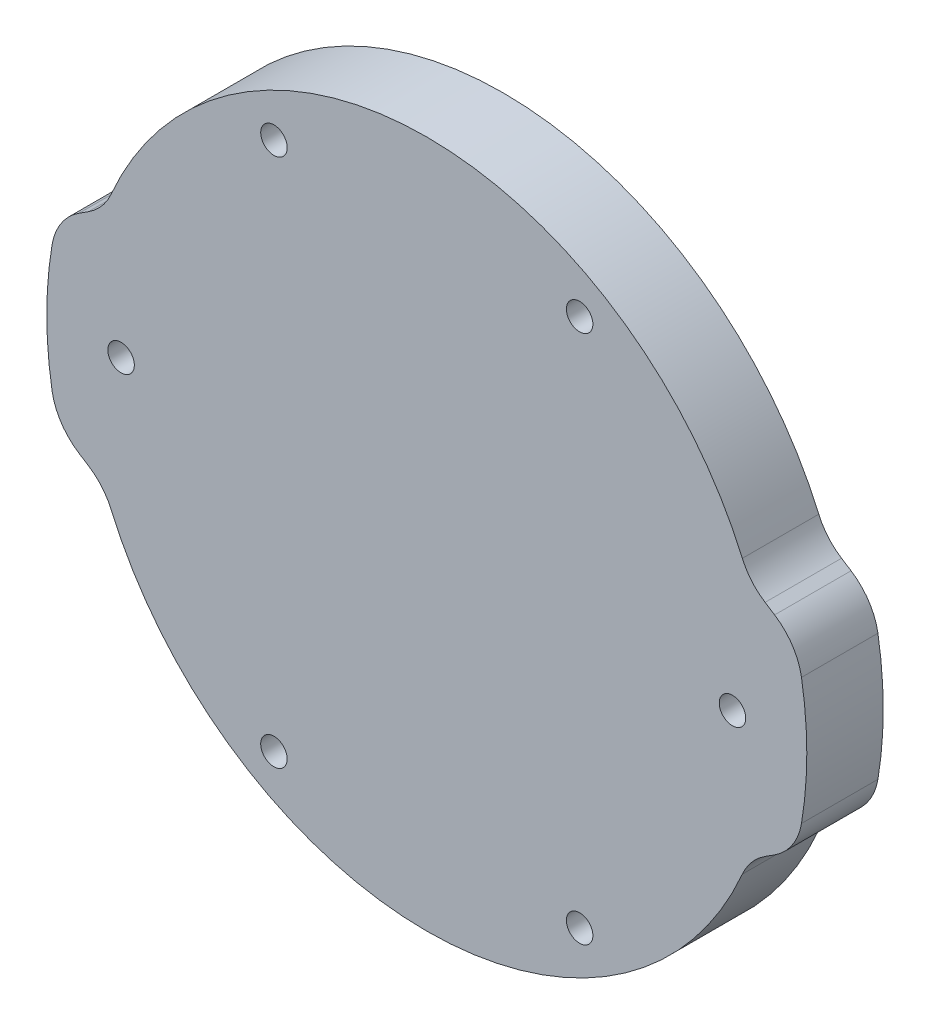
ISO-10303-21;
HEADER;
FILE_DESCRIPTION(('STEP AP214'),'2;1');
FILE_NAME('part.step','',(''),(''),'','','');
FILE_SCHEMA(('AUTOMOTIVE_DESIGN { 1 0 10303 214 1 1 1 1 }'));
ENDSEC;
DATA;
#1=APPLICATION_CONTEXT('core data for automotive mechanical design processes');
#2=APPLICATION_PROTOCOL_DEFINITION('international standard','automotive_design',2000,#1);
#3=PRODUCT_CONTEXT('',#1,'mechanical');
#4=PRODUCT('Part','Part','',(#3));
#5=PRODUCT_RELATED_PRODUCT_CATEGORY('part','',(#4));
#6=PRODUCT_DEFINITION_FORMATION('','',#4);
#7=PRODUCT_DEFINITION_CONTEXT('part definition',#1,'design');
#8=PRODUCT_DEFINITION('design','',#6,#7);
#9=PRODUCT_DEFINITION_SHAPE('','',#8);
#10=(LENGTH_UNIT() NAMED_UNIT(*) SI_UNIT(.MILLI.,.METRE.));
#11=(NAMED_UNIT(*) PLANE_ANGLE_UNIT() SI_UNIT($,.RADIAN.));
#12=(NAMED_UNIT(*) SI_UNIT($,.STERADIAN.) SOLID_ANGLE_UNIT());
#13=UNCERTAINTY_MEASURE_WITH_UNIT(LENGTH_MEASURE(1.E-05),#10,'distance_accuracy_value','');
#14=(GEOMETRIC_REPRESENTATION_CONTEXT(3) GLOBAL_UNCERTAINTY_ASSIGNED_CONTEXT((#13)) GLOBAL_UNIT_ASSIGNED_CONTEXT((#10,
#11,#12)) REPRESENTATION_CONTEXT('',''));
#15=CARTESIAN_POINT('',(0.,0.,0.));
#16=DIRECTION('',(0.,0.,1.));
#17=DIRECTION('',(1.,0.,0.));
#18=AXIS2_PLACEMENT_3D('',#15,#16,#17);
#19=CARTESIAN_POINT('',(0.,0.,6.35));
#20=DIRECTION('',(0.,0.,-1.));
#21=DIRECTION('',(-1.,0.,0.));
#22=AXIS2_PLACEMENT_3D('',#19,#20,#21);
#23=PLANE('',#22);
#24=CARTESIAN_POINT('',(25.4000000000023,0.,6.35));
#25=DIRECTION('',(0.,0.,1.));
#26=DIRECTION('',(1.,0.,0.));
#27=AXIS2_PLACEMENT_3D('',#24,#25,#26);
#28=CIRCLE('',#27,1.10000000000001);
#29=CARTESIAN_POINT('',(26.5000000000024,0.,6.35));
#30=VERTEX_POINT('',#29);
#31=EDGE_CURVE('E556',#30,#30,#28,.T.);
#32=ORIENTED_EDGE('',*,*,#31,.F.);
#33=EDGE_LOOP('',(#32));
#34=FACE_BOUND('',#33,.T.);
#35=CARTESIAN_POINT('',(-12.7000000000012,21.9970452561268,6.35));
#36=DIRECTION('',(0.,0.,1.));
#37=DIRECTION('',(1.,0.,0.));
#38=AXIS2_PLACEMENT_3D('',#35,#36,#37);
#39=CIRCLE('',#38,1.1);
#40=CARTESIAN_POINT('',(-11.6000000000012,21.9970452561268,6.35));
#41=VERTEX_POINT('',#40);
#42=EDGE_CURVE('E568',#41,#41,#39,.T.);
#43=ORIENTED_EDGE('',*,*,#42,.F.);
#44=EDGE_LOOP('',(#43));
#45=FACE_BOUND('',#44,.T.);
#46=CARTESIAN_POINT('',(-25.4000000000023,0.,6.35));
#47=DIRECTION('',(0.,0.,1.));
#48=DIRECTION('',(1.,0.,0.));
#49=AXIS2_PLACEMENT_3D('',#46,#47,#48);
#50=CIRCLE('',#49,1.1);
#51=CARTESIAN_POINT('',(-24.3000000000023,0.,6.35));
#52=VERTEX_POINT('',#51);
#53=EDGE_CURVE('E306',#52,#52,#50,.T.);
#54=ORIENTED_EDGE('',*,*,#53,.F.);
#55=EDGE_LOOP('',(#54));
#56=FACE_BOUND('',#55,.T.);
#57=CARTESIAN_POINT('',(0.,0.,6.35));
#58=DIRECTION('',(0.,0.,1.));
#59=DIRECTION('',(-1.,0.,0.));
#60=AXIS2_PLACEMENT_3D('',#57,#58,#59);
#61=CIRCLE('',#60,31.575);
#62=CARTESIAN_POINT('',(31.1345138238998,-5.25572772785986,6.35));
#63=VERTEX_POINT('',#62);
#64=CARTESIAN_POINT('',(31.1345138238998,5.25572772785986,6.35));
#65=VERTEX_POINT('',#64);
#66=EDGE_CURVE('E195',#63,#65,#61,.T.);
#67=ORIENTED_EDGE('',*,*,#66,.T.);
#68=CARTESIAN_POINT('',(26.2042661874944,4.42346680500002,6.35));
#69=DIRECTION('',(0.,0.,-1.));
#70=DIRECTION('',(-1.,0.,0.));
#71=AXIS2_PLACEMENT_3D('',#68,#69,#70);
#72=CIRCLE('',#71,5.);
#73=CARTESIAN_POINT('',(28.9010073987016,8.63388089862276,6.35));
#74=VERTEX_POINT('',#73);
#75=EDGE_CURVE('E220',#65,#74,#72,.F.);
#76=ORIENTED_EDGE('',*,*,#75,.T.);
#77=DIRECTION('',(-0.842082818724548,0.53934824224143,0.));
#78=VECTOR('',#77,1.);
#79=CARTESIAN_POINT('',(30.6713322990704,7.50000000000001,6.35));
#80=LINE('',#79,#78);
#81=CARTESIAN_POINT('',(28.1095056204985,9.14083233298568,6.35));
#82=VERTEX_POINT('',#81);
#83=EDGE_CURVE('E297',#74,#82,#80,.T.);
#84=ORIENTED_EDGE('',*,*,#83,.T.);
#85=CARTESIAN_POINT('',(30.8062468317057,13.3512464266084,6.35));
#86=DIRECTION('',(0.,0.,-1.));
#87=DIRECTION('',(-1.,0.,0.));
#88=AXIS2_PLACEMENT_3D('',#85,#86,#87);
#89=CIRCLE('',#88,5.);
#90=CARTESIAN_POINT('',(26.2185704606401,11.3629744345595,6.35));
#91=VERTEX_POINT('',#90);
#92=EDGE_CURVE('E158',#82,#91,#89,.T.);
#93=ORIENTED_EDGE('',*,*,#92,.T.);
#94=CARTESIAN_POINT('',(0.,0.,6.35));
#95=DIRECTION('',(0.,0.,1.));
#96=DIRECTION('',(1.,0.,0.));
#97=AXIS2_PLACEMENT_3D('',#94,#95,#96);
#98=CIRCLE('',#97,28.575);
#99=CARTESIAN_POINT('',(-26.2185704606401,11.3629744345595,6.35));
#100=VERTEX_POINT('',#99);
#101=EDGE_CURVE('E168',#91,#100,#98,.T.);
#102=ORIENTED_EDGE('',*,*,#101,.T.);
#103=CARTESIAN_POINT('',(-30.8062468317057,13.3512464266084,6.35));
#104=DIRECTION('',(0.,0.,-1.));
#105=DIRECTION('',(-1.,0.,0.));
#106=AXIS2_PLACEMENT_3D('',#103,#104,#105);
#107=CIRCLE('',#106,5.);
#108=CARTESIAN_POINT('',(-28.1095056204985,9.14083233298567,6.35));
#109=VERTEX_POINT('',#108);
#110=EDGE_CURVE('E11',#100,#109,#107,.T.);
#111=ORIENTED_EDGE('',*,*,#110,.T.);
#112=DIRECTION('',(-0.842082818724547,-0.539348242241431,0.));
#113=VECTOR('',#112,1.);
#114=CARTESIAN_POINT('',(-30.6713322990704,7.5,6.35));
#115=LINE('',#114,#113);
#116=CARTESIAN_POINT('',(-28.9010073987016,8.63388089862276,6.35));
#117=VERTEX_POINT('',#116);
#118=EDGE_CURVE('E292',#109,#117,#115,.T.);
#119=ORIENTED_EDGE('',*,*,#118,.T.);
#120=CARTESIAN_POINT('',(-26.2042661874944,4.42346680500002,6.35));
#121=DIRECTION('',(0.,0.,-1.));
#122=DIRECTION('',(-1.,0.,0.));
#123=AXIS2_PLACEMENT_3D('',#120,#121,#122);
#124=CIRCLE('',#123,5.);
#125=CARTESIAN_POINT('',(-31.1345138238998,5.25572772785986,6.35));
#126=VERTEX_POINT('',#125);
#127=EDGE_CURVE('E214',#117,#126,#124,.F.);
#128=ORIENTED_EDGE('',*,*,#127,.T.);
#129=CARTESIAN_POINT('',(0.,0.,6.35));
#130=DIRECTION('',(0.,0.,1.));
#131=DIRECTION('',(1.,0.,0.));
#132=AXIS2_PLACEMENT_3D('',#129,#130,#131);
#133=CIRCLE('',#132,31.575);
#134=CARTESIAN_POINT('',(-31.1345138238998,-5.25572772785986,6.35));
#135=VERTEX_POINT('',#134);
#136=EDGE_CURVE('E283',#126,#135,#133,.T.);
#137=ORIENTED_EDGE('',*,*,#136,.T.);
#138=CARTESIAN_POINT('',(-26.2042661874944,-4.42346680500002,6.35));
#139=DIRECTION('',(0.,0.,-1.));
#140=DIRECTION('',(-1.,0.,0.));
#141=AXIS2_PLACEMENT_3D('',#138,#139,#140);
#142=CIRCLE('',#141,5.);
#143=CARTESIAN_POINT('',(-28.9010073987016,-8.63388089862276,6.35));
#144=VERTEX_POINT('',#143);
#145=EDGE_CURVE('E216',#135,#144,#142,.F.);
#146=ORIENTED_EDGE('',*,*,#145,.T.);
#147=DIRECTION('',(0.842082818724547,-0.539348242241431,0.));
#148=VECTOR('',#147,1.);
#149=CARTESIAN_POINT('',(-30.6713322990704,-7.5,6.35));
#150=LINE('',#149,#148);
#151=CARTESIAN_POINT('',(-28.1095056204985,-9.14083233298567,6.35));
#152=VERTEX_POINT('',#151);
#153=EDGE_CURVE('E259',#144,#152,#150,.T.);
#154=ORIENTED_EDGE('',*,*,#153,.T.);
#155=CARTESIAN_POINT('',(-30.8062468317057,-13.3512464266084,6.35));
#156=DIRECTION('',(0.,0.,-1.));
#157=DIRECTION('',(-1.,0.,0.));
#158=AXIS2_PLACEMENT_3D('',#155,#156,#157);
#159=CIRCLE('',#158,5.);
#160=CARTESIAN_POINT('',(-26.2185704606401,-11.3629744345595,6.35));
#161=VERTEX_POINT('',#160);
#162=EDGE_CURVE('E251',#152,#161,#159,.T.);
#163=ORIENTED_EDGE('',*,*,#162,.T.);
#164=CARTESIAN_POINT('',(0.,0.,6.35));
#165=DIRECTION('',(0.,0.,1.));
#166=DIRECTION('',(1.,0.,0.));
#167=AXIS2_PLACEMENT_3D('',#164,#165,#166);
#168=CIRCLE('',#167,28.575);
#169=CARTESIAN_POINT('',(26.2185704606401,-11.3629744345595,6.35));
#170=VERTEX_POINT('',#169);
#171=EDGE_CURVE('E257',#161,#170,#168,.T.);
#172=ORIENTED_EDGE('',*,*,#171,.T.);
#173=CARTESIAN_POINT('',(30.8062468317057,-13.3512464266084,6.35));
#174=DIRECTION('',(0.,0.,-1.));
#175=DIRECTION('',(-1.,0.,0.));
#176=AXIS2_PLACEMENT_3D('',#173,#174,#175);
#177=CIRCLE('',#176,5.);
#178=CARTESIAN_POINT('',(28.1095056204985,-9.14083233298568,6.35));
#179=VERTEX_POINT('',#178);
#180=EDGE_CURVE('E56',#170,#179,#177,.T.);
#181=ORIENTED_EDGE('',*,*,#180,.T.);
#182=DIRECTION('',(0.842082818724548,0.53934824224143,0.));
#183=VECTOR('',#182,1.);
#184=CARTESIAN_POINT('',(30.6713322990704,-7.50000000000001,6.35));
#185=LINE('',#184,#183);
#186=CARTESIAN_POINT('',(28.9010073987016,-8.63388089862276,6.35));
#187=VERTEX_POINT('',#186);
#188=EDGE_CURVE('E196',#179,#187,#185,.T.);
#189=ORIENTED_EDGE('',*,*,#188,.T.);
#190=CARTESIAN_POINT('',(26.2042661874944,-4.42346680500002,6.35));
#191=DIRECTION('',(0.,0.,-1.));
#192=DIRECTION('',(-1.,0.,0.));
#193=AXIS2_PLACEMENT_3D('',#190,#191,#192);
#194=CIRCLE('',#193,5.);
#195=EDGE_CURVE('E218',#187,#63,#194,.F.);
#196=ORIENTED_EDGE('',*,*,#195,.T.);
#197=EDGE_LOOP('',(#67,#76,#84,#93,#102,#111,#119,#128,#137,#146,#154,#163,#172,#181,#189,#196));
#198=FACE_BOUND('',#197,.T.);
#199=CARTESIAN_POINT('',(12.7000000000012,-21.9970452561268,6.35));
#200=DIRECTION('',(0.,0.,1.));
#201=DIRECTION('',(1.,0.,0.));
#202=AXIS2_PLACEMENT_3D('',#199,#200,#201);
#203=CIRCLE('',#202,1.1);
#204=CARTESIAN_POINT('',(13.8000000000012,-21.9970452561268,6.35));
#205=VERTEX_POINT('',#204);
#206=EDGE_CURVE('E316',#205,#205,#203,.T.);
#207=ORIENTED_EDGE('',*,*,#206,.F.);
#208=EDGE_LOOP('',(#207));
#209=FACE_BOUND('',#208,.T.);
#210=CARTESIAN_POINT('',(12.7000000000012,21.9970452561268,6.35));
#211=DIRECTION('',(0.,0.,1.));
#212=DIRECTION('',(1.,0.,0.));
#213=AXIS2_PLACEMENT_3D('',#210,#211,#212);
#214=CIRCLE('',#213,1.1);
#215=CARTESIAN_POINT('',(13.8000000000012,21.9970452561268,6.35));
#216=VERTEX_POINT('',#215);
#217=EDGE_CURVE('E562',#216,#216,#214,.T.);
#218=ORIENTED_EDGE('',*,*,#217,.F.);
#219=EDGE_LOOP('',(#218));
#220=FACE_BOUND('',#219,.T.);
#221=CARTESIAN_POINT('',(-12.7000000000012,-21.9970452561268,6.35));
#222=DIRECTION('',(0.,0.,1.));
#223=DIRECTION('',(1.,0.,0.));
#224=AXIS2_PLACEMENT_3D('',#221,#222,#223);
#225=CIRCLE('',#224,1.1);
#226=CARTESIAN_POINT('',(-11.6000000000012,-21.9970452561268,6.35));
#227=VERTEX_POINT('',#226);
#228=EDGE_CURVE('E547',#227,#227,#225,.T.);
#229=ORIENTED_EDGE('',*,*,#228,.F.);
#230=EDGE_LOOP('',(#229));
#231=FACE_BOUND('',#230,.T.);
#232=ADVANCED_FACE('F34',(#34,#45,#56,#198,#209,#220,#231),#23,.F.);
#233=CARTESIAN_POINT('',(0.,0.,0.));
#234=DIRECTION('',(0.,0.,-1.));
#235=DIRECTION('',(-1.,0.,0.));
#236=AXIS2_PLACEMENT_3D('',#233,#234,#235);
#237=PLANE('',#236);
#238=CARTESIAN_POINT('',(25.4000000000023,0.,0.));
#239=DIRECTION('',(0.,0.,1.));
#240=DIRECTION('',(1.,0.,0.));
#241=AXIS2_PLACEMENT_3D('',#238,#239,#240);
#242=CIRCLE('',#241,1.10000000000001);
#243=CARTESIAN_POINT('',(26.5000000000024,0.,0.));
#244=VERTEX_POINT('',#243);
#245=EDGE_CURVE('E553',#244,#244,#242,.T.);
#246=ORIENTED_EDGE('',*,*,#245,.T.);
#247=EDGE_LOOP('',(#246));
#248=FACE_BOUND('',#247,.T.);
#249=CARTESIAN_POINT('',(-12.7000000000012,21.9970452561268,0.));
#250=DIRECTION('',(0.,0.,1.));
#251=DIRECTION('',(1.,0.,0.));
#252=AXIS2_PLACEMENT_3D('',#249,#250,#251);
#253=CIRCLE('',#252,1.1);
#254=CARTESIAN_POINT('',(-11.6000000000012,21.9970452561268,0.));
#255=VERTEX_POINT('',#254);
#256=EDGE_CURVE('E565',#255,#255,#253,.T.);
#257=ORIENTED_EDGE('',*,*,#256,.T.);
#258=EDGE_LOOP('',(#257));
#259=FACE_BOUND('',#258,.T.);
#260=CARTESIAN_POINT('',(-25.4000000000023,0.,0.));
#261=DIRECTION('',(0.,0.,1.));
#262=DIRECTION('',(1.,0.,0.));
#263=AXIS2_PLACEMENT_3D('',#260,#261,#262);
#264=CIRCLE('',#263,1.1);
#265=CARTESIAN_POINT('',(-24.3000000000023,0.,0.));
#266=VERTEX_POINT('',#265);
#267=EDGE_CURVE('E311',#266,#266,#264,.T.);
#268=ORIENTED_EDGE('',*,*,#267,.T.);
#269=EDGE_LOOP('',(#268));
#270=FACE_BOUND('',#269,.T.);
#271=DIRECTION('',(-0.842082818724548,0.53934824224143,0.));
#272=VECTOR('',#271,1.);
#273=CARTESIAN_POINT('',(30.6713322990704,7.50000000000001,0.));
#274=LINE('',#273,#272);
#275=CARTESIAN_POINT('',(28.9010073987016,8.63388089862276,0.));
#276=VERTEX_POINT('',#275);
#277=CARTESIAN_POINT('',(28.1095056204985,9.14083233298568,0.));
#278=VERTEX_POINT('',#277);
#279=EDGE_CURVE('E176',#276,#278,#274,.T.);
#280=ORIENTED_EDGE('',*,*,#279,.F.);
#281=CARTESIAN_POINT('',(26.2042661874944,4.42346680500002,0.));
#282=DIRECTION('',(0.,0.,-1.));
#283=DIRECTION('',(-1.,0.,0.));
#284=AXIS2_PLACEMENT_3D('',#281,#282,#283);
#285=CIRCLE('',#284,5.);
#286=CARTESIAN_POINT('',(31.1345138238998,5.25572772785986,0.));
#287=VERTEX_POINT('',#286);
#288=EDGE_CURVE('E207',#276,#287,#285,.T.);
#289=ORIENTED_EDGE('',*,*,#288,.T.);
#290=CARTESIAN_POINT('',(0.,0.,0.));
#291=DIRECTION('',(0.,0.,1.));
#292=DIRECTION('',(-1.,0.,0.));
#293=AXIS2_PLACEMENT_3D('',#290,#291,#292);
#294=CIRCLE('',#293,31.575);
#295=CARTESIAN_POINT('',(31.1345138238998,-5.25572772785986,0.));
#296=VERTEX_POINT('',#295);
#297=EDGE_CURVE('E181',#296,#287,#294,.T.);
#298=ORIENTED_EDGE('',*,*,#297,.F.);
#299=CARTESIAN_POINT('',(26.2042661874944,-4.42346680500002,0.));
#300=DIRECTION('',(0.,0.,-1.));
#301=DIRECTION('',(-1.,0.,0.));
#302=AXIS2_PLACEMENT_3D('',#299,#300,#301);
#303=CIRCLE('',#302,5.);
#304=CARTESIAN_POINT('',(28.9010073987016,-8.63388089862276,0.));
#305=VERTEX_POINT('',#304);
#306=EDGE_CURVE('E205',#296,#305,#303,.T.);
#307=ORIENTED_EDGE('',*,*,#306,.T.);
#308=DIRECTION('',(0.842082818724548,0.53934824224143,0.));
#309=VECTOR('',#308,1.);
#310=CARTESIAN_POINT('',(30.6713322990704,-7.50000000000001,0.));
#311=LINE('',#310,#309);
#312=CARTESIAN_POINT('',(28.1095056204985,-9.14083233298568,0.));
#313=VERTEX_POINT('',#312);
#314=EDGE_CURVE('E193',#313,#305,#311,.T.);
#315=ORIENTED_EDGE('',*,*,#314,.F.);
#316=CARTESIAN_POINT('',(30.8062468317057,-13.3512464266084,0.));
#317=DIRECTION('',(0.,0.,-1.));
#318=DIRECTION('',(-1.,0.,0.));
#319=AXIS2_PLACEMENT_3D('',#316,#317,#318);
#320=CIRCLE('',#319,5.);
#321=CARTESIAN_POINT('',(26.2185704606401,-11.3629744345595,0.));
#322=VERTEX_POINT('',#321);
#323=EDGE_CURVE('E246',#313,#322,#320,.F.);
#324=ORIENTED_EDGE('',*,*,#323,.T.);
#325=CARTESIAN_POINT('',(0.,0.,0.));
#326=DIRECTION('',(0.,0.,1.));
#327=DIRECTION('',(1.,0.,0.));
#328=AXIS2_PLACEMENT_3D('',#325,#326,#327);
#329=CIRCLE('',#328,28.575);
#330=CARTESIAN_POINT('',(-26.2185704606401,-11.3629744345595,0.));
#331=VERTEX_POINT('',#330);
#332=EDGE_CURVE('E190',#331,#322,#329,.T.);
#333=ORIENTED_EDGE('',*,*,#332,.F.);
#334=CARTESIAN_POINT('',(-30.8062468317057,-13.3512464266084,0.));
#335=DIRECTION('',(0.,0.,-1.));
#336=DIRECTION('',(-1.,0.,0.));
#337=AXIS2_PLACEMENT_3D('',#334,#335,#336);
#338=CIRCLE('',#337,5.);
#339=CARTESIAN_POINT('',(-28.1095056204985,-9.14083233298567,0.));
#340=VERTEX_POINT('',#339);
#341=EDGE_CURVE('E249',#331,#340,#338,.F.);
#342=ORIENTED_EDGE('',*,*,#341,.T.);
#343=DIRECTION('',(0.842082818724547,-0.539348242241431,0.));
#344=VECTOR('',#343,1.);
#345=CARTESIAN_POINT('',(-30.6713322990704,-7.5,0.));
#346=LINE('',#345,#344);
#347=CARTESIAN_POINT('',(-28.9010073987016,-8.63388089862276,0.));
#348=VERTEX_POINT('',#347);
#349=EDGE_CURVE('E187',#348,#340,#346,.T.);
#350=ORIENTED_EDGE('',*,*,#349,.F.);
#351=CARTESIAN_POINT('',(-26.2042661874944,-4.42346680500002,0.));
#352=DIRECTION('',(0.,0.,-1.));
#353=DIRECTION('',(-1.,0.,0.));
#354=AXIS2_PLACEMENT_3D('',#351,#352,#353);
#355=CIRCLE('',#354,5.);
#356=CARTESIAN_POINT('',(-31.1345138238998,-5.25572772785986,0.));
#357=VERTEX_POINT('',#356);
#358=EDGE_CURVE('E203',#348,#357,#355,.T.);
#359=ORIENTED_EDGE('',*,*,#358,.T.);
#360=CARTESIAN_POINT('',(0.,0.,0.));
#361=DIRECTION('',(0.,0.,1.));
#362=DIRECTION('',(1.,0.,0.));
#363=AXIS2_PLACEMENT_3D('',#360,#361,#362);
#364=CIRCLE('',#363,31.575);
#365=CARTESIAN_POINT('',(-31.1345138238998,5.25572772785986,0.));
#366=VERTEX_POINT('',#365);
#367=EDGE_CURVE('E179',#366,#357,#364,.T.);
#368=ORIENTED_EDGE('',*,*,#367,.F.);
#369=CARTESIAN_POINT('',(-26.2042661874944,4.42346680500002,0.));
#370=DIRECTION('',(0.,0.,-1.));
#371=DIRECTION('',(-1.,0.,0.));
#372=AXIS2_PLACEMENT_3D('',#369,#370,#371);
#373=CIRCLE('',#372,5.);
#374=CARTESIAN_POINT('',(-28.9010073987016,8.63388089862276,0.));
#375=VERTEX_POINT('',#374);
#376=EDGE_CURVE('E201',#366,#375,#373,.T.);
#377=ORIENTED_EDGE('',*,*,#376,.T.);
#378=DIRECTION('',(-0.842082818724547,-0.539348242241431,0.));
#379=VECTOR('',#378,1.);
#380=CARTESIAN_POINT('',(-30.6713322990704,7.5,0.));
#381=LINE('',#380,#379);
#382=CARTESIAN_POINT('',(-28.1095056204985,9.14083233298567,0.));
#383=VERTEX_POINT('',#382);
#384=EDGE_CURVE('E175',#383,#375,#381,.T.);
#385=ORIENTED_EDGE('',*,*,#384,.F.);
#386=CARTESIAN_POINT('',(-30.8062468317057,13.3512464266084,0.));
#387=DIRECTION('',(0.,0.,-1.));
#388=DIRECTION('',(-1.,0.,0.));
#389=AXIS2_PLACEMENT_3D('',#386,#387,#388);
#390=CIRCLE('',#389,5.);
#391=CARTESIAN_POINT('',(-26.2185704606401,11.3629744345595,0.));
#392=VERTEX_POINT('',#391);
#393=EDGE_CURVE('E42',#383,#392,#390,.F.);
#394=ORIENTED_EDGE('',*,*,#393,.T.);
#395=CARTESIAN_POINT('',(0.,0.,0.));
#396=DIRECTION('',(0.,0.,1.));
#397=DIRECTION('',(1.,0.,0.));
#398=AXIS2_PLACEMENT_3D('',#395,#396,#397);
#399=CIRCLE('',#398,28.575);
#400=CARTESIAN_POINT('',(26.2185704606401,11.3629744345595,0.));
#401=VERTEX_POINT('',#400);
#402=EDGE_CURVE('E165',#401,#392,#399,.T.);
#403=ORIENTED_EDGE('',*,*,#402,.F.);
#404=CARTESIAN_POINT('',(30.8062468317057,13.3512464266084,0.));
#405=DIRECTION('',(0.,0.,-1.));
#406=DIRECTION('',(-1.,0.,0.));
#407=AXIS2_PLACEMENT_3D('',#404,#405,#406);
#408=CIRCLE('',#407,5.);
#409=EDGE_CURVE('E148',#401,#278,#408,.F.);
#410=ORIENTED_EDGE('',*,*,#409,.T.);
#411=EDGE_LOOP('',(#280,#289,#298,#307,#315,#324,#333,#342,#350,#359,#368,#377,#385,#394,#403,#410));
#412=FACE_BOUND('',#411,.T.);
#413=CARTESIAN_POINT('',(12.7000000000012,-21.9970452561268,0.));
#414=DIRECTION('',(0.,0.,1.));
#415=DIRECTION('',(1.,0.,0.));
#416=AXIS2_PLACEMENT_3D('',#413,#414,#415);
#417=CIRCLE('',#416,1.1);
#418=CARTESIAN_POINT('',(13.8000000000012,-21.9970452561268,0.));
#419=VERTEX_POINT('',#418);
#420=EDGE_CURVE('E319',#419,#419,#417,.T.);
#421=ORIENTED_EDGE('',*,*,#420,.T.);
#422=EDGE_LOOP('',(#421));
#423=FACE_BOUND('',#422,.T.);
#424=CARTESIAN_POINT('',(12.7000000000012,21.9970452561268,0.));
#425=DIRECTION('',(0.,0.,1.));
#426=DIRECTION('',(1.,0.,0.));
#427=AXIS2_PLACEMENT_3D('',#424,#425,#426);
#428=CIRCLE('',#427,1.1);
#429=CARTESIAN_POINT('',(13.8000000000012,21.9970452561268,0.));
#430=VERTEX_POINT('',#429);
#431=EDGE_CURVE('E559',#430,#430,#428,.T.);
#432=ORIENTED_EDGE('',*,*,#431,.T.);
#433=EDGE_LOOP('',(#432));
#434=FACE_BOUND('',#433,.T.);
#435=CARTESIAN_POINT('',(-12.7000000000012,-21.9970452561268,0.));
#436=DIRECTION('',(0.,0.,1.));
#437=DIRECTION('',(1.,0.,0.));
#438=AXIS2_PLACEMENT_3D('',#435,#436,#437);
#439=CIRCLE('',#438,1.1);
#440=CARTESIAN_POINT('',(-11.6000000000012,-21.9970452561268,0.));
#441=VERTEX_POINT('',#440);
#442=EDGE_CURVE('E550',#441,#441,#439,.T.);
#443=ORIENTED_EDGE('',*,*,#442,.T.);
#444=EDGE_LOOP('',(#443));
#445=FACE_BOUND('',#444,.T.);
#446=ADVANCED_FACE('F172',(#248,#259,#270,#412,#423,#434,#445),#237,.T.);
#447=CARTESIAN_POINT('',(0.,0.,6.35));
#448=DIRECTION('',(0.,0.,-1.));
#449=DIRECTION('',(-1.,0.,0.));
#450=AXIS2_PLACEMENT_3D('',#447,#448,#449);
#451=CYLINDRICAL_SURFACE('',#450,31.575);
#452=ORIENTED_EDGE('',*,*,#297,.T.);
#453=DIRECTION('',(0.,0.,-1.));
#454=VECTOR('',#453,1.);
#455=CARTESIAN_POINT('',(31.1345138238998,5.25572772785986,6.35));
#456=LINE('',#455,#454);
#457=EDGE_CURVE('E212',#287,#65,#456,.F.);
#458=ORIENTED_EDGE('',*,*,#457,.T.);
#459=ORIENTED_EDGE('',*,*,#66,.F.);
#460=DIRECTION('',(0.,0.,-1.));
#461=VECTOR('',#460,1.);
#462=CARTESIAN_POINT('',(31.1345138238998,-5.25572772785986,6.35));
#463=LINE('',#462,#461);
#464=EDGE_CURVE('E209',#63,#296,#463,.T.);
#465=ORIENTED_EDGE('',*,*,#464,.T.);
#466=EDGE_LOOP('',(#452,#458,#459,#465));
#467=FACE_BOUND('',#466,.T.);
#468=ADVANCED_FACE('F336',(#467),#451,.T.);
#469=CARTESIAN_POINT('',(30.6713322990704,7.50000000000001,6.35));
#470=DIRECTION('',(-0.53934824224143,-0.842082818724548,0.));
#471=DIRECTION('',(0.842082818724548,-0.53934824224143,0.));
#472=AXIS2_PLACEMENT_3D('',#469,#470,#471);
#473=PLANE('',#472);
#474=ORIENTED_EDGE('',*,*,#279,.T.);
#475=DIRECTION('',(0.,0.,1.));
#476=VECTOR('',#475,1.);
#477=CARTESIAN_POINT('',(28.1095056204985,9.14083233298568,6.35));
#478=LINE('',#477,#476);
#479=EDGE_CURVE('E153',#278,#82,#478,.T.);
#480=ORIENTED_EDGE('',*,*,#479,.T.);
#481=ORIENTED_EDGE('',*,*,#83,.F.);
#482=DIRECTION('',(0.,0.,-1.));
#483=VECTOR('',#482,1.);
#484=CARTESIAN_POINT('',(28.9010073987016,8.63388089862276,6.35));
#485=LINE('',#484,#483);
#486=EDGE_CURVE('E169',#74,#276,#485,.T.);
#487=ORIENTED_EDGE('',*,*,#486,.T.);
#488=EDGE_LOOP('',(#474,#480,#481,#487));
#489=FACE_BOUND('',#488,.T.);
#490=ADVANCED_FACE('F330',(#489),#473,.F.);
#491=CARTESIAN_POINT('',(0.,0.,6.35));
#492=DIRECTION('',(0.,0.,-1.));
#493=DIRECTION('',(-1.,0.,0.));
#494=AXIS2_PLACEMENT_3D('',#491,#492,#493);
#495=CYLINDRICAL_SURFACE('',#494,28.575);
#496=ORIENTED_EDGE('',*,*,#101,.F.);
#497=DIRECTION('',(0.,0.,-1.));
#498=VECTOR('',#497,1.);
#499=CARTESIAN_POINT('',(26.2185704606401,11.3629744345595,6.35));
#500=LINE('',#499,#498);
#501=EDGE_CURVE('E152',#91,#401,#500,.T.);
#502=ORIENTED_EDGE('',*,*,#501,.T.);
#503=ORIENTED_EDGE('',*,*,#402,.T.);
#504=DIRECTION('',(0.,0.,-1.));
#505=VECTOR('',#504,1.);
#506=CARTESIAN_POINT('',(-26.2185704606401,11.3629744345595,6.35));
#507=LINE('',#506,#505);
#508=EDGE_CURVE('E170',#392,#100,#507,.F.);
#509=ORIENTED_EDGE('',*,*,#508,.T.);
#510=EDGE_LOOP('',(#496,#502,#503,#509));
#511=FACE_BOUND('',#510,.T.);
#512=ADVANCED_FACE('F164',(#511),#495,.T.);
#513=CARTESIAN_POINT('',(-30.6713322990704,7.5,6.35));
#514=DIRECTION('',(0.539348242241431,-0.842082818724547,0.));
#515=DIRECTION('',(0.842082818724547,0.539348242241431,0.));
#516=AXIS2_PLACEMENT_3D('',#513,#514,#515);
#517=PLANE('',#516);
#518=ORIENTED_EDGE('',*,*,#118,.F.);
#519=DIRECTION('',(0.,0.,1.));
#520=VECTOR('',#519,1.);
#521=CARTESIAN_POINT('',(-28.1095056204985,9.14083233298567,0.));
#522=LINE('',#521,#520);
#523=EDGE_CURVE('E159',#109,#383,#522,.F.);
#524=ORIENTED_EDGE('',*,*,#523,.T.);
#525=ORIENTED_EDGE('',*,*,#384,.T.);
#526=DIRECTION('',(0.,0.,-1.));
#527=VECTOR('',#526,1.);
#528=CARTESIAN_POINT('',(-28.9010073987016,8.63388089862276,6.35));
#529=LINE('',#528,#527);
#530=EDGE_CURVE('E241',#375,#117,#529,.F.);
#531=ORIENTED_EDGE('',*,*,#530,.T.);
#532=EDGE_LOOP('',(#518,#524,#525,#531));
#533=FACE_BOUND('',#532,.T.);
#534=ADVANCED_FACE('F289',(#533),#517,.F.);
#535=CARTESIAN_POINT('',(0.,0.,6.35));
#536=DIRECTION('',(0.,0.,-1.));
#537=DIRECTION('',(-1.,0.,0.));
#538=AXIS2_PLACEMENT_3D('',#535,#536,#537);
#539=CYLINDRICAL_SURFACE('',#538,31.575);
#540=ORIENTED_EDGE('',*,*,#367,.T.);
#541=DIRECTION('',(0.,0.,-1.));
#542=VECTOR('',#541,1.);
#543=CARTESIAN_POINT('',(-31.1345138238998,-5.25572772785986,6.35));
#544=LINE('',#543,#542);
#545=EDGE_CURVE('E239',#357,#135,#544,.F.);
#546=ORIENTED_EDGE('',*,*,#545,.T.);
#547=ORIENTED_EDGE('',*,*,#136,.F.);
#548=DIRECTION('',(0.,0.,-1.));
#549=VECTOR('',#548,1.);
#550=CARTESIAN_POINT('',(-31.1345138238998,5.25572772785986,6.35));
#551=LINE('',#550,#549);
#552=EDGE_CURVE('E236',#126,#366,#551,.T.);
#553=ORIENTED_EDGE('',*,*,#552,.T.);
#554=EDGE_LOOP('',(#540,#546,#547,#553));
#555=FACE_BOUND('',#554,.T.);
#556=ADVANCED_FACE('F279',(#555),#539,.T.);
#557=CARTESIAN_POINT('',(-30.6713322990704,-7.5,6.35));
#558=DIRECTION('',(0.539348242241431,0.842082818724547,0.));
#559=DIRECTION('',(-0.842082818724547,0.539348242241431,0.));
#560=AXIS2_PLACEMENT_3D('',#557,#558,#559);
#561=PLANE('',#560);
#562=ORIENTED_EDGE('',*,*,#349,.T.);
#563=DIRECTION('',(0.,0.,1.));
#564=VECTOR('',#563,1.);
#565=CARTESIAN_POINT('',(-28.1095056204985,-9.14083233298567,6.35));
#566=LINE('',#565,#564);
#567=EDGE_CURVE('E234',#340,#152,#566,.T.);
#568=ORIENTED_EDGE('',*,*,#567,.T.);
#569=ORIENTED_EDGE('',*,*,#153,.F.);
#570=DIRECTION('',(0.,0.,-1.));
#571=VECTOR('',#570,1.);
#572=CARTESIAN_POINT('',(-28.9010073987016,-8.63388089862276,6.35));
#573=LINE('',#572,#571);
#574=EDGE_CURVE('E231',#144,#348,#573,.T.);
#575=ORIENTED_EDGE('',*,*,#574,.T.);
#576=EDGE_LOOP('',(#562,#568,#569,#575));
#577=FACE_BOUND('',#576,.T.);
#578=ADVANCED_FACE('F271',(#577),#561,.F.);
#579=CARTESIAN_POINT('',(0.,0.,6.35));
#580=DIRECTION('',(0.,0.,-1.));
#581=DIRECTION('',(-1.,0.,0.));
#582=AXIS2_PLACEMENT_3D('',#579,#580,#581);
#583=CYLINDRICAL_SURFACE('',#582,28.575);
#584=ORIENTED_EDGE('',*,*,#332,.T.);
#585=DIRECTION('',(0.,0.,-1.));
#586=VECTOR('',#585,1.);
#587=CARTESIAN_POINT('',(26.2185704606401,-11.3629744345595,6.35));
#588=LINE('',#587,#586);
#589=EDGE_CURVE('E229',#322,#170,#588,.F.);
#590=ORIENTED_EDGE('',*,*,#589,.T.);
#591=ORIENTED_EDGE('',*,*,#171,.F.);
#592=DIRECTION('',(0.,0.,-1.));
#593=VECTOR('',#592,1.);
#594=CARTESIAN_POINT('',(-26.2185704606401,-11.3629744345595,6.35));
#595=LINE('',#594,#593);
#596=EDGE_CURVE('E226',#161,#331,#595,.T.);
#597=ORIENTED_EDGE('',*,*,#596,.T.);
#598=EDGE_LOOP('',(#584,#590,#591,#597));
#599=FACE_BOUND('',#598,.T.);
#600=ADVANCED_FACE('F264',(#599),#583,.T.);
#601=CARTESIAN_POINT('',(30.6713322990704,-7.50000000000001,6.35));
#602=DIRECTION('',(-0.53934824224143,0.842082818724548,0.));
#603=DIRECTION('',(-0.842082818724548,-0.53934824224143,0.));
#604=AXIS2_PLACEMENT_3D('',#601,#602,#603);
#605=PLANE('',#604);
#606=ORIENTED_EDGE('',*,*,#314,.T.);
#607=DIRECTION('',(0.,0.,-1.));
#608=VECTOR('',#607,1.);
#609=CARTESIAN_POINT('',(28.9010073987016,-8.63388089862276,6.35));
#610=LINE('',#609,#608);
#611=EDGE_CURVE('E49',#305,#187,#610,.F.);
#612=ORIENTED_EDGE('',*,*,#611,.T.);
#613=ORIENTED_EDGE('',*,*,#188,.F.);
#614=DIRECTION('',(0.,0.,1.));
#615=VECTOR('',#614,1.);
#616=CARTESIAN_POINT('',(28.1095056204985,-9.14083233298568,0.));
#617=LINE('',#616,#615);
#618=EDGE_CURVE('E222',#179,#313,#617,.F.);
#619=ORIENTED_EDGE('',*,*,#618,.T.);
#620=EDGE_LOOP('',(#606,#612,#613,#619));
#621=FACE_BOUND('',#620,.T.);
#622=ADVANCED_FACE('F333',(#621),#605,.F.);
#623=CARTESIAN_POINT('',(-25.4000000000023,0.,6.35));
#624=DIRECTION('',(0.,0.,-1.));
#625=DIRECTION('',(-1.,0.,0.));
#626=AXIS2_PLACEMENT_3D('',#623,#624,#625);
#627=CYLINDRICAL_SURFACE('',#626,1.1);
#628=ORIENTED_EDGE('',*,*,#53,.T.);
#629=EDGE_LOOP('',(#628));
#630=FACE_BOUND('',#629,.T.);
#631=ORIENTED_EDGE('',*,*,#267,.F.);
#632=EDGE_LOOP('',(#631));
#633=FACE_BOUND('',#632,.T.);
#634=ADVANCED_FACE('F355',(#630,#633),#627,.F.);
#635=CARTESIAN_POINT('',(12.7000000000012,-21.9970452561268,6.35));
#636=DIRECTION('',(0.,0.,-1.));
#637=DIRECTION('',(-1.,0.,0.));
#638=AXIS2_PLACEMENT_3D('',#635,#636,#637);
#639=CYLINDRICAL_SURFACE('',#638,1.1);
#640=ORIENTED_EDGE('',*,*,#206,.T.);
#641=EDGE_LOOP('',(#640));
#642=FACE_BOUND('',#641,.T.);
#643=ORIENTED_EDGE('',*,*,#420,.F.);
#644=EDGE_LOOP('',(#643));
#645=FACE_BOUND('',#644,.T.);
#646=ADVANCED_FACE('F400',(#642,#645),#639,.F.);
#647=CARTESIAN_POINT('',(-12.7000000000012,21.9970452561268,6.35));
#648=DIRECTION('',(0.,0.,-1.));
#649=DIRECTION('',(-1.,0.,0.));
#650=AXIS2_PLACEMENT_3D('',#647,#648,#649);
#651=CYLINDRICAL_SURFACE('',#650,1.1);
#652=ORIENTED_EDGE('',*,*,#42,.T.);
#653=EDGE_LOOP('',(#652));
#654=FACE_BOUND('',#653,.T.);
#655=ORIENTED_EDGE('',*,*,#256,.F.);
#656=EDGE_LOOP('',(#655));
#657=FACE_BOUND('',#656,.T.);
#658=ADVANCED_FACE('F406',(#654,#657),#651,.F.);
#659=CARTESIAN_POINT('',(12.7000000000012,21.9970452561268,6.35));
#660=DIRECTION('',(0.,0.,-1.));
#661=DIRECTION('',(-1.,0.,0.));
#662=AXIS2_PLACEMENT_3D('',#659,#660,#661);
#663=CYLINDRICAL_SURFACE('',#662,1.1);
#664=ORIENTED_EDGE('',*,*,#217,.T.);
#665=EDGE_LOOP('',(#664));
#666=FACE_BOUND('',#665,.T.);
#667=ORIENTED_EDGE('',*,*,#431,.F.);
#668=EDGE_LOOP('',(#667));
#669=FACE_BOUND('',#668,.T.);
#670=ADVANCED_FACE('F413',(#666,#669),#663,.F.);
#671=CARTESIAN_POINT('',(25.4000000000023,0.,6.35));
#672=DIRECTION('',(0.,0.,-1.));
#673=DIRECTION('',(-1.,0.,0.));
#674=AXIS2_PLACEMENT_3D('',#671,#672,#673);
#675=CYLINDRICAL_SURFACE('',#674,1.10000000000001);
#676=ORIENTED_EDGE('',*,*,#31,.T.);
#677=EDGE_LOOP('',(#676));
#678=FACE_BOUND('',#677,.T.);
#679=ORIENTED_EDGE('',*,*,#245,.F.);
#680=EDGE_LOOP('',(#679));
#681=FACE_BOUND('',#680,.T.);
#682=ADVANCED_FACE('F421',(#678,#681),#675,.F.);
#683=CARTESIAN_POINT('',(-12.7000000000012,-21.9970452561268,6.35));
#684=DIRECTION('',(0.,0.,-1.));
#685=DIRECTION('',(-1.,0.,0.));
#686=AXIS2_PLACEMENT_3D('',#683,#684,#685);
#687=CYLINDRICAL_SURFACE('',#686,1.1);
#688=ORIENTED_EDGE('',*,*,#228,.T.);
#689=EDGE_LOOP('',(#688));
#690=FACE_BOUND('',#689,.T.);
#691=ORIENTED_EDGE('',*,*,#442,.F.);
#692=EDGE_LOOP('',(#691));
#693=FACE_BOUND('',#692,.T.);
#694=ADVANCED_FACE('F429',(#690,#693),#687,.F.);
#695=CARTESIAN_POINT('',(30.8062468317057,13.3512464266084,6.35));
#696=DIRECTION('',(0.,0.,-1.));
#697=DIRECTION('',(-1.,0.,0.));
#698=AXIS2_PLACEMENT_3D('',#695,#696,#697);
#699=CYLINDRICAL_SURFACE('',#698,5.);
#700=ORIENTED_EDGE('',*,*,#92,.F.);
#701=ORIENTED_EDGE('',*,*,#479,.F.);
#702=ORIENTED_EDGE('',*,*,#409,.F.);
#703=ORIENTED_EDGE('',*,*,#501,.F.);
#704=EDGE_LOOP('',(#700,#701,#702,#703));
#705=FACE_BOUND('',#704,.T.);
#706=ADVANCED_FACE('F151',(#705),#699,.F.);
#707=CARTESIAN_POINT('',(26.2042661874944,4.42346680500002,6.35));
#708=DIRECTION('',(0.,0.,-1.));
#709=DIRECTION('',(-1.,0.,0.));
#710=AXIS2_PLACEMENT_3D('',#707,#708,#709);
#711=CYLINDRICAL_SURFACE('',#710,5.);
#712=ORIENTED_EDGE('',*,*,#75,.F.);
#713=ORIENTED_EDGE('',*,*,#457,.F.);
#714=ORIENTED_EDGE('',*,*,#288,.F.);
#715=ORIENTED_EDGE('',*,*,#486,.F.);
#716=EDGE_LOOP('',(#712,#713,#714,#715));
#717=FACE_BOUND('',#716,.T.);
#718=ADVANCED_FACE('F328',(#717),#711,.T.);
#719=CARTESIAN_POINT('',(26.2042661874944,-4.42346680500002,6.35));
#720=DIRECTION('',(0.,0.,-1.));
#721=DIRECTION('',(-1.,0.,0.));
#722=AXIS2_PLACEMENT_3D('',#719,#720,#721);
#723=CYLINDRICAL_SURFACE('',#722,5.);
#724=ORIENTED_EDGE('',*,*,#195,.F.);
#725=ORIENTED_EDGE('',*,*,#611,.F.);
#726=ORIENTED_EDGE('',*,*,#306,.F.);
#727=ORIENTED_EDGE('',*,*,#464,.F.);
#728=EDGE_LOOP('',(#724,#725,#726,#727));
#729=FACE_BOUND('',#728,.T.);
#730=ADVANCED_FACE('F335',(#729),#723,.T.);
#731=CARTESIAN_POINT('',(30.8062468317057,-13.3512464266084,6.35));
#732=DIRECTION('',(0.,0.,-1.));
#733=DIRECTION('',(-1.,0.,0.));
#734=AXIS2_PLACEMENT_3D('',#731,#732,#733);
#735=CYLINDRICAL_SURFACE('',#734,5.);
#736=ORIENTED_EDGE('',*,*,#180,.F.);
#737=ORIENTED_EDGE('',*,*,#589,.F.);
#738=ORIENTED_EDGE('',*,*,#323,.F.);
#739=ORIENTED_EDGE('',*,*,#618,.F.);
#740=EDGE_LOOP('',(#736,#737,#738,#739));
#741=FACE_BOUND('',#740,.T.);
#742=ADVANCED_FACE('F454',(#741),#735,.F.);
#743=CARTESIAN_POINT('',(-30.8062468317057,-13.3512464266084,6.35));
#744=DIRECTION('',(0.,0.,-1.));
#745=DIRECTION('',(-1.,0.,0.));
#746=AXIS2_PLACEMENT_3D('',#743,#744,#745);
#747=CYLINDRICAL_SURFACE('',#746,5.);
#748=ORIENTED_EDGE('',*,*,#162,.F.);
#749=ORIENTED_EDGE('',*,*,#567,.F.);
#750=ORIENTED_EDGE('',*,*,#341,.F.);
#751=ORIENTED_EDGE('',*,*,#596,.F.);
#752=EDGE_LOOP('',(#748,#749,#750,#751));
#753=FACE_BOUND('',#752,.T.);
#754=ADVANCED_FACE('F268',(#753),#747,.F.);
#755=CARTESIAN_POINT('',(-26.2042661874944,-4.42346680500002,6.35));
#756=DIRECTION('',(0.,0.,-1.));
#757=DIRECTION('',(-1.,0.,0.));
#758=AXIS2_PLACEMENT_3D('',#755,#756,#757);
#759=CYLINDRICAL_SURFACE('',#758,5.);
#760=ORIENTED_EDGE('',*,*,#145,.F.);
#761=ORIENTED_EDGE('',*,*,#545,.F.);
#762=ORIENTED_EDGE('',*,*,#358,.F.);
#763=ORIENTED_EDGE('',*,*,#574,.F.);
#764=EDGE_LOOP('',(#760,#761,#762,#763));
#765=FACE_BOUND('',#764,.T.);
#766=ADVANCED_FACE('F275',(#765),#759,.T.);
#767=CARTESIAN_POINT('',(-30.8062468317057,13.3512464266084,6.35));
#768=DIRECTION('',(0.,0.,-1.));
#769=DIRECTION('',(-1.,0.,0.));
#770=AXIS2_PLACEMENT_3D('',#767,#768,#769);
#771=CYLINDRICAL_SURFACE('',#770,5.);
#772=ORIENTED_EDGE('',*,*,#110,.F.);
#773=ORIENTED_EDGE('',*,*,#508,.F.);
#774=ORIENTED_EDGE('',*,*,#393,.F.);
#775=ORIENTED_EDGE('',*,*,#523,.F.);
#776=EDGE_LOOP('',(#772,#773,#774,#775));
#777=FACE_BOUND('',#776,.T.);
#778=ADVANCED_FACE('F295',(#777),#771,.F.);
#779=CARTESIAN_POINT('',(-26.2042661874944,4.42346680500002,6.35));
#780=DIRECTION('',(0.,0.,-1.));
#781=DIRECTION('',(-1.,0.,0.));
#782=AXIS2_PLACEMENT_3D('',#779,#780,#781);
#783=CYLINDRICAL_SURFACE('',#782,5.);
#784=ORIENTED_EDGE('',*,*,#127,.F.);
#785=ORIENTED_EDGE('',*,*,#530,.F.);
#786=ORIENTED_EDGE('',*,*,#376,.F.);
#787=ORIENTED_EDGE('',*,*,#552,.F.);
#788=EDGE_LOOP('',(#784,#785,#786,#787));
#789=FACE_BOUND('',#788,.T.);
#790=ADVANCED_FACE('F36',(#789),#783,.T.);
#791=CLOSED_SHELL('',(#232,#446,#468,#490,#512,#534,#556,#578,#600,#622,#634,#646,#658,#670,
#682,#694,#706,#718,#730,#742,#754,#766,#778,#790));
#792=MANIFOLD_SOLID_BREP('B2',#791);
#793=ADVANCED_BREP_SHAPE_REPRESENTATION('',(#18,#792),#14);
#794=SHAPE_DEFINITION_REPRESENTATION(#9,#793);
ENDSEC;
END-ISO-10303-21;
